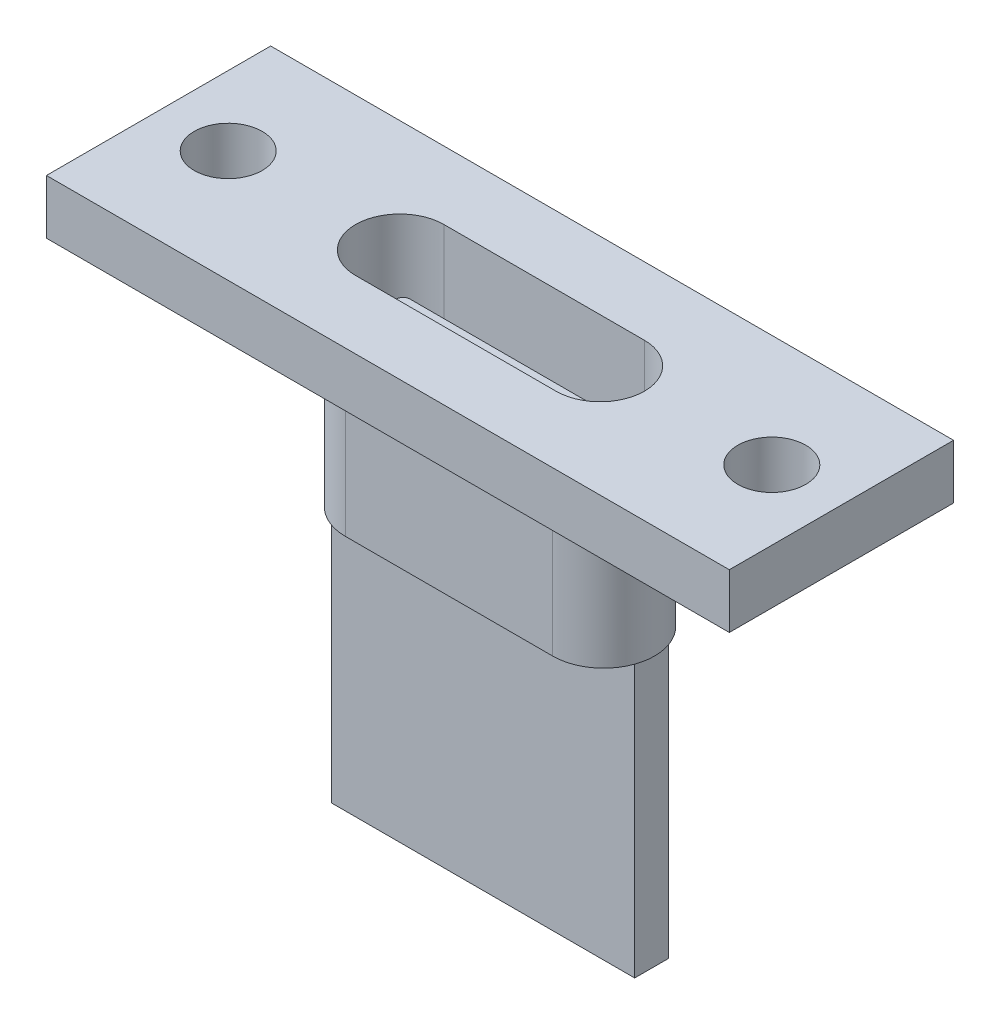
ISO-10303-21;
HEADER;
FILE_DESCRIPTION(('STEP AP214'),'2;1');
FILE_NAME('part.step','',(''),(''),'','','');
FILE_SCHEMA(('AUTOMOTIVE_DESIGN { 1 0 10303 214 1 1 1 1 }'));
ENDSEC;
DATA;
#1=APPLICATION_CONTEXT('core data for automotive mechanical design processes');
#2=APPLICATION_PROTOCOL_DEFINITION('international standard','automotive_design',2000,#1);
#3=PRODUCT_CONTEXT('',#1,'mechanical');
#4=PRODUCT('Part','Part','',(#3));
#5=PRODUCT_RELATED_PRODUCT_CATEGORY('part','',(#4));
#6=PRODUCT_DEFINITION_FORMATION('','',#4);
#7=PRODUCT_DEFINITION_CONTEXT('part definition',#1,'design');
#8=PRODUCT_DEFINITION('design','',#6,#7);
#9=PRODUCT_DEFINITION_SHAPE('','',#8);
#10=(LENGTH_UNIT() NAMED_UNIT(*) SI_UNIT(.MILLI.,.METRE.));
#11=(NAMED_UNIT(*) PLANE_ANGLE_UNIT() SI_UNIT($,.RADIAN.));
#12=(NAMED_UNIT(*) SI_UNIT($,.STERADIAN.) SOLID_ANGLE_UNIT());
#13=UNCERTAINTY_MEASURE_WITH_UNIT(LENGTH_MEASURE(1.E-05),#10,'distance_accuracy_value','');
#14=(GEOMETRIC_REPRESENTATION_CONTEXT(3) GLOBAL_UNCERTAINTY_ASSIGNED_CONTEXT((#13)) GLOBAL_UNIT_ASSIGNED_CONTEXT((#10,
#11,#12)) REPRESENTATION_CONTEXT('',''));
#15=CARTESIAN_POINT('',(0.,0.,0.));
#16=DIRECTION('',(0.,0.,1.));
#17=DIRECTION('',(1.,0.,0.));
#18=AXIS2_PLACEMENT_3D('',#15,#16,#17);
#19=CARTESIAN_POINT('',(-2.95,-3.4,0.));
#20=DIRECTION('',(0.,1.,0.));
#21=DIRECTION('',(0.,0.,1.));
#22=AXIS2_PLACEMENT_3D('',#19,#20,#21);
#23=PLANE('',#22);
#24=CARTESIAN_POINT('',(-2.95,-3.4,0.));
#25=DIRECTION('',(0.,1.,0.));
#26=DIRECTION('',(0.,0.,1.));
#27=AXIS2_PLACEMENT_3D('',#24,#25,#26);
#28=CIRCLE('',#27,1.3);
#29=CARTESIAN_POINT('',(-2.95,-3.4,-1.3));
#30=VERTEX_POINT('',#29);
#31=CARTESIAN_POINT('',(-2.95,-3.4,1.3));
#32=VERTEX_POINT('',#31);
#33=EDGE_CURVE('E244',#30,#32,#28,.T.);
#34=ORIENTED_EDGE('',*,*,#33,.T.);
#35=DIRECTION('',(1.,0.,0.));
#36=VECTOR('',#35,1.);
#37=CARTESIAN_POINT('',(-2.95,-3.4,1.3));
#38=LINE('',#37,#36);
#39=CARTESIAN_POINT('',(2.95,-3.4,1.3));
#40=VERTEX_POINT('',#39);
#41=EDGE_CURVE('E248',#32,#40,#38,.T.);
#42=ORIENTED_EDGE('',*,*,#41,.T.);
#43=CARTESIAN_POINT('',(2.95,-3.4,0.));
#44=DIRECTION('',(0.,1.,0.));
#45=DIRECTION('',(0.,0.,1.));
#46=AXIS2_PLACEMENT_3D('',#43,#44,#45);
#47=CIRCLE('',#46,1.3);
#48=CARTESIAN_POINT('',(2.95,-3.4,-1.3));
#49=VERTEX_POINT('',#48);
#50=EDGE_CURVE('E253',#40,#49,#47,.T.);
#51=ORIENTED_EDGE('',*,*,#50,.T.);
#52=DIRECTION('',(-1.,0.,0.));
#53=VECTOR('',#52,1.);
#54=CARTESIAN_POINT('',(-2.95,-3.4,-1.3));
#55=LINE('',#54,#53);
#56=EDGE_CURVE('E257',#49,#30,#55,.T.);
#57=ORIENTED_EDGE('',*,*,#56,.T.);
#58=EDGE_LOOP('',(#34,#42,#51,#57));
#59=FACE_BOUND('',#58,.T.);
#60=DIRECTION('',(-1.,0.,0.));
#61=VECTOR('',#60,1.);
#62=CARTESIAN_POINT('',(-3.05,-3.4,-0.4));
#63=LINE('',#62,#61);
#64=CARTESIAN_POINT('',(3.05,-3.4,-0.4));
#65=VERTEX_POINT('',#64);
#66=CARTESIAN_POINT('',(-3.05,-3.4,-0.4));
#67=VERTEX_POINT('',#66);
#68=EDGE_CURVE('E744',#65,#67,#63,.T.);
#69=ORIENTED_EDGE('',*,*,#68,.F.);
#70=CARTESIAN_POINT('',(3.05,-3.4,-0.2));
#71=DIRECTION('',(0.,1.,0.));
#72=DIRECTION('',(0.,0.,-1.));
#73=AXIS2_PLACEMENT_3D('',#70,#71,#72);
#74=CIRCLE('',#73,0.2);
#75=CARTESIAN_POINT('',(3.25,-3.4,-0.199999999999999));
#76=VERTEX_POINT('',#75);
#77=EDGE_CURVE('E232',#76,#65,#74,.T.);
#78=ORIENTED_EDGE('',*,*,#77,.F.);
#79=DIRECTION('',(0.,0.,-1.));
#80=VECTOR('',#79,1.);
#81=CARTESIAN_POINT('',(3.25,-3.4,0.199999999999999));
#82=LINE('',#81,#80);
#83=CARTESIAN_POINT('',(3.25,-3.4,0.199999999999999));
#84=VERTEX_POINT('',#83);
#85=EDGE_CURVE('E228',#84,#76,#82,.T.);
#86=ORIENTED_EDGE('',*,*,#85,.F.);
#87=CARTESIAN_POINT('',(3.05,-3.4,0.2));
#88=DIRECTION('',(0.,1.,0.));
#89=DIRECTION('',(0.,0.,1.));
#90=AXIS2_PLACEMENT_3D('',#87,#88,#89);
#91=CIRCLE('',#90,0.2);
#92=CARTESIAN_POINT('',(3.05,-3.4,0.4));
#93=VERTEX_POINT('',#92);
#94=EDGE_CURVE('E739',#93,#84,#91,.T.);
#95=ORIENTED_EDGE('',*,*,#94,.F.);
#96=DIRECTION('',(1.,0.,0.));
#97=VECTOR('',#96,1.);
#98=CARTESIAN_POINT('',(-3.05,-3.4,0.4));
#99=LINE('',#98,#97);
#100=CARTESIAN_POINT('',(-3.05,-3.4,0.4));
#101=VERTEX_POINT('',#100);
#102=EDGE_CURVE('E761',#101,#93,#99,.T.);
#103=ORIENTED_EDGE('',*,*,#102,.F.);
#104=CARTESIAN_POINT('',(-3.05,-3.4,0.2));
#105=DIRECTION('',(0.,1.,0.));
#106=DIRECTION('',(0.,0.,-1.));
#107=AXIS2_PLACEMENT_3D('',#104,#105,#106);
#108=CIRCLE('',#107,0.2);
#109=CARTESIAN_POINT('',(-3.25,-3.4,0.199999999999999));
#110=VERTEX_POINT('',#109);
#111=EDGE_CURVE('E758',#110,#101,#108,.T.);
#112=ORIENTED_EDGE('',*,*,#111,.F.);
#113=DIRECTION('',(0.,0.,1.));
#114=VECTOR('',#113,1.);
#115=CARTESIAN_POINT('',(-3.25,-3.4,0.199999999999999));
#116=LINE('',#115,#114);
#117=CARTESIAN_POINT('',(-3.25,-3.4,-0.199999999999998));
#118=VERTEX_POINT('',#117);
#119=EDGE_CURVE('E755',#118,#110,#116,.T.);
#120=ORIENTED_EDGE('',*,*,#119,.F.);
#121=CARTESIAN_POINT('',(-3.05,-3.4,-0.2));
#122=DIRECTION('',(0.,1.,0.));
#123=DIRECTION('',(0.,0.,-1.));
#124=AXIS2_PLACEMENT_3D('',#121,#122,#123);
#125=CIRCLE('',#124,0.2);
#126=EDGE_CURVE('E748',#67,#118,#125,.T.);
#127=ORIENTED_EDGE('',*,*,#126,.F.);
#128=EDGE_LOOP('',(#69,#78,#86,#95,#103,#112,#120,#127));
#129=FACE_BOUND('',#128,.T.);
#130=ADVANCED_FACE('F45',(#59,#129),#23,.T.);
#131=CARTESIAN_POINT('',(-3.05,-5.,0.));
#132=DIRECTION('',(0.,-1.,0.));
#133=DIRECTION('',(0.,0.,-1.));
#134=AXIS2_PLACEMENT_3D('',#131,#132,#133);
#135=PLANE('',#134);
#136=DIRECTION('',(0.,0.,1.));
#137=VECTOR('',#136,1.);
#138=CARTESIAN_POINT('',(4.4642135623731,-5.,-0.5));
#139=LINE('',#138,#137);
#140=CARTESIAN_POINT('',(4.4642135623731,-5.,-0.5));
#141=VERTEX_POINT('',#140);
#142=CARTESIAN_POINT('',(4.4642135623731,-5.,0.5));
#143=VERTEX_POINT('',#142);
#144=EDGE_CURVE('E275',#141,#143,#139,.T.);
#145=ORIENTED_EDGE('',*,*,#144,.F.);
#146=CARTESIAN_POINT('',(3.05,-5.,0.));
#147=DIRECTION('',(0.,-1.,0.));
#148=DIRECTION('',(0.,0.,-1.));
#149=AXIS2_PLACEMENT_3D('',#146,#147,#148);
#150=CIRCLE('',#149,1.5);
#151=EDGE_CURVE('E343',#141,#143,#150,.T.);
#152=ORIENTED_EDGE('',*,*,#151,.T.);
#153=EDGE_LOOP('',(#145,#152));
#154=FACE_BOUND('',#153,.T.);
#155=ADVANCED_FACE('F453',(#154),#135,.T.);
#156=DIRECTION('',(1.,0.,0.));
#157=VECTOR('',#156,1.);
#158=CARTESIAN_POINT('',(-4.4642135623731,-5.,-0.5));
#159=LINE('',#158,#157);
#160=CARTESIAN_POINT('',(-4.4642135623731,-5.,-0.499999999999998));
#161=VERTEX_POINT('',#160);
#162=EDGE_CURVE('E289',#161,#141,#159,.T.);
#163=ORIENTED_EDGE('',*,*,#162,.F.);
#164=CARTESIAN_POINT('',(-3.05,-5.,0.));
#165=DIRECTION('',(0.,-1.,0.));
#166=DIRECTION('',(0.,0.,-1.));
#167=AXIS2_PLACEMENT_3D('',#164,#165,#166);
#168=CIRCLE('',#167,1.5);
#169=CARTESIAN_POINT('',(-3.05,-5.,-1.5));
#170=VERTEX_POINT('',#169);
#171=EDGE_CURVE('E334',#161,#170,#168,.T.);
#172=ORIENTED_EDGE('',*,*,#171,.T.);
#173=DIRECTION('',(1.,0.,0.));
#174=VECTOR('',#173,1.);
#175=CARTESIAN_POINT('',(-3.05,-5.,-1.5));
#176=LINE('',#175,#174);
#177=CARTESIAN_POINT('',(3.05,-5.,-1.5));
#178=VERTEX_POINT('',#177);
#179=EDGE_CURVE('E332',#170,#178,#176,.T.);
#180=ORIENTED_EDGE('',*,*,#179,.T.);
#181=EDGE_CURVE('E338',#178,#141,#150,.T.);
#182=ORIENTED_EDGE('',*,*,#181,.T.);
#183=EDGE_LOOP('',(#163,#172,#180,#182));
#184=FACE_BOUND('',#183,.T.);
#185=ADVANCED_FACE('F461',(#184),#135,.T.);
#186=DIRECTION('',(0.,0.,-1.));
#187=VECTOR('',#186,1.);
#188=CARTESIAN_POINT('',(-4.4642135623731,-5.,-0.5));
#189=LINE('',#188,#187);
#190=CARTESIAN_POINT('',(-4.4642135623731,-5.,0.5));
#191=VERTEX_POINT('',#190);
#192=EDGE_CURVE('E306',#191,#161,#189,.T.);
#193=ORIENTED_EDGE('',*,*,#192,.F.);
#194=EDGE_CURVE('E333',#191,#161,#168,.T.);
#195=ORIENTED_EDGE('',*,*,#194,.T.);
#196=EDGE_LOOP('',(#193,#195));
#197=FACE_BOUND('',#196,.T.);
#198=ADVANCED_FACE('F506',(#197),#135,.T.);
#199=CARTESIAN_POINT('',(0.,0.,0.));
#200=DIRECTION('',(0.,-1.,0.));
#201=DIRECTION('',(0.,0.,-1.));
#202=AXIS2_PLACEMENT_3D('',#199,#200,#201);
#203=PLANE('',#202);
#204=CARTESIAN_POINT('',(8.,0.,0.));
#205=DIRECTION('',(0.,-1.,0.));
#206=DIRECTION('',(0.,0.,-1.));
#207=AXIS2_PLACEMENT_3D('',#204,#205,#206);
#208=CIRCLE('',#207,1.);
#209=CARTESIAN_POINT('',(8.,0.,-1.));
#210=VERTEX_POINT('',#209);
#211=EDGE_CURVE('E379',#210,#210,#208,.F.);
#212=ORIENTED_EDGE('',*,*,#211,.T.);
#213=EDGE_LOOP('',(#212));
#214=FACE_BOUND('',#213,.T.);
#215=CARTESIAN_POINT('',(-8.,0.,0.));
#216=DIRECTION('',(0.,-1.,0.));
#217=DIRECTION('',(0.,0.,-1.));
#218=AXIS2_PLACEMENT_3D('',#215,#216,#217);
#219=CIRCLE('',#218,1.);
#220=CARTESIAN_POINT('',(-8.,0.,-0.999999999999998));
#221=VERTEX_POINT('',#220);
#222=EDGE_CURVE('E383',#221,#221,#219,.F.);
#223=ORIENTED_EDGE('',*,*,#222,.T.);
#224=EDGE_LOOP('',(#223));
#225=FACE_BOUND('',#224,.T.);
#226=DIRECTION('',(0.,0.,-1.));
#227=VECTOR('',#226,1.);
#228=CARTESIAN_POINT('',(10.05,0.,3.3));
#229=LINE('',#228,#227);
#230=CARTESIAN_POINT('',(10.05,0.,3.3));
#231=VERTEX_POINT('',#230);
#232=CARTESIAN_POINT('',(10.05,0.,-3.3));
#233=VERTEX_POINT('',#232);
#234=EDGE_CURVE('E378',#231,#233,#229,.T.);
#235=ORIENTED_EDGE('',*,*,#234,.F.);
#236=DIRECTION('',(1.,0.,0.));
#237=VECTOR('',#236,1.);
#238=CARTESIAN_POINT('',(-10.05,0.,3.3));
#239=LINE('',#238,#237);
#240=CARTESIAN_POINT('',(-10.05,0.,3.3));
#241=VERTEX_POINT('',#240);
#242=EDGE_CURVE('E395',#241,#231,#239,.T.);
#243=ORIENTED_EDGE('',*,*,#242,.F.);
#244=DIRECTION('',(0.,0.,1.));
#245=VECTOR('',#244,1.);
#246=CARTESIAN_POINT('',(-10.05,0.,3.3));
#247=LINE('',#246,#245);
#248=CARTESIAN_POINT('',(-10.05,0.,-3.3));
#249=VERTEX_POINT('',#248);
#250=EDGE_CURVE('E411',#249,#241,#247,.T.);
#251=ORIENTED_EDGE('',*,*,#250,.F.);
#252=DIRECTION('',(-1.,0.,0.));
#253=VECTOR('',#252,1.);
#254=CARTESIAN_POINT('',(-10.05,0.,-3.3));
#255=LINE('',#254,#253);
#256=EDGE_CURVE('E408',#233,#249,#255,.T.);
#257=ORIENTED_EDGE('',*,*,#256,.F.);
#258=EDGE_LOOP('',(#235,#243,#251,#257));
#259=FACE_BOUND('',#258,.T.);
#260=DIRECTION('',(1.,0.,0.));
#261=VECTOR('',#260,1.);
#262=CARTESIAN_POINT('',(-3.05,0.,-1.5));
#263=LINE('',#262,#261);
#264=CARTESIAN_POINT('',(-3.05,0.,-1.5));
#265=VERTEX_POINT('',#264);
#266=CARTESIAN_POINT('',(3.05,0.,-1.5));
#267=VERTEX_POINT('',#266);
#268=EDGE_CURVE('E350',#265,#267,#263,.T.);
#269=ORIENTED_EDGE('',*,*,#268,.F.);
#270=CARTESIAN_POINT('',(-3.05,0.,0.));
#271=DIRECTION('',(0.,-1.,0.));
#272=DIRECTION('',(0.,0.,-1.));
#273=AXIS2_PLACEMENT_3D('',#270,#271,#272);
#274=CIRCLE('',#273,1.5);
#275=CARTESIAN_POINT('',(-3.05,0.,1.5));
#276=VERTEX_POINT('',#275);
#277=EDGE_CURVE('E328',#276,#265,#274,.T.);
#278=ORIENTED_EDGE('',*,*,#277,.F.);
#279=DIRECTION('',(-1.,0.,0.));
#280=VECTOR('',#279,1.);
#281=CARTESIAN_POINT('',(-3.05,0.,1.5));
#282=LINE('',#281,#280);
#283=CARTESIAN_POINT('',(3.05,0.,1.5));
#284=VERTEX_POINT('',#283);
#285=EDGE_CURVE('E357',#284,#276,#282,.T.);
#286=ORIENTED_EDGE('',*,*,#285,.F.);
#287=CARTESIAN_POINT('',(3.05,0.,0.));
#288=DIRECTION('',(0.,-1.,0.));
#289=DIRECTION('',(0.,0.,-1.));
#290=AXIS2_PLACEMENT_3D('',#287,#288,#289);
#291=CIRCLE('',#290,1.5);
#292=EDGE_CURVE('E353',#267,#284,#291,.T.);
#293=ORIENTED_EDGE('',*,*,#292,.F.);
#294=EDGE_LOOP('',(#269,#278,#286,#293));
#295=FACE_BOUND('',#294,.T.);
#296=ADVANCED_FACE('F434',(#214,#225,#259,#295),#203,.T.);
#297=CARTESIAN_POINT('',(10.05,1.6,3.3));
#298=DIRECTION('',(-1.,0.,0.));
#299=DIRECTION('',(0.,0.,1.));
#300=AXIS2_PLACEMENT_3D('',#297,#298,#299);
#301=PLANE('',#300);
#302=ORIENTED_EDGE('',*,*,#234,.T.);
#303=DIRECTION('',(0.,-1.,0.));
#304=VECTOR('',#303,1.);
#305=CARTESIAN_POINT('',(10.05,1.6,-3.3));
#306=LINE('',#305,#304);
#307=CARTESIAN_POINT('',(10.05,1.6,-3.3));
#308=VERTEX_POINT('',#307);
#309=EDGE_CURVE('E11',#308,#233,#306,.T.);
#310=ORIENTED_EDGE('',*,*,#309,.F.);
#311=DIRECTION('',(0.,0.,-1.));
#312=VECTOR('',#311,1.);
#313=CARTESIAN_POINT('',(10.05,1.6,3.3));
#314=LINE('',#313,#312);
#315=CARTESIAN_POINT('',(10.05,1.6,3.3));
#316=VERTEX_POINT('',#315);
#317=EDGE_CURVE('E390',#316,#308,#314,.T.);
#318=ORIENTED_EDGE('',*,*,#317,.F.);
#319=DIRECTION('',(0.,-1.,0.));
#320=VECTOR('',#319,1.);
#321=CARTESIAN_POINT('',(10.05,1.6,3.3));
#322=LINE('',#321,#320);
#323=EDGE_CURVE('E404',#316,#231,#322,.T.);
#324=ORIENTED_EDGE('',*,*,#323,.T.);
#325=EDGE_LOOP('',(#302,#310,#318,#324));
#326=FACE_BOUND('',#325,.T.);
#327=ADVANCED_FACE('F47',(#326),#301,.F.);
#328=CARTESIAN_POINT('',(-10.05,1.6,-3.3));
#329=DIRECTION('',(0.,0.,1.));
#330=DIRECTION('',(1.,0.,0.));
#331=AXIS2_PLACEMENT_3D('',#328,#329,#330);
#332=PLANE('',#331);
#333=ORIENTED_EDGE('',*,*,#256,.T.);
#334=DIRECTION('',(0.,-1.,0.));
#335=VECTOR('',#334,1.);
#336=CARTESIAN_POINT('',(-10.05,1.6,-3.3));
#337=LINE('',#336,#335);
#338=CARTESIAN_POINT('',(-10.05,1.6,-3.3));
#339=VERTEX_POINT('',#338);
#340=EDGE_CURVE('E54',#339,#249,#337,.T.);
#341=ORIENTED_EDGE('',*,*,#340,.F.);
#342=DIRECTION('',(-1.,0.,0.));
#343=VECTOR('',#342,1.);
#344=CARTESIAN_POINT('',(-10.05,1.6,-3.3));
#345=LINE('',#344,#343);
#346=EDGE_CURVE('E394',#308,#339,#345,.T.);
#347=ORIENTED_EDGE('',*,*,#346,.F.);
#348=ORIENTED_EDGE('',*,*,#309,.T.);
#349=EDGE_LOOP('',(#333,#341,#347,#348));
#350=FACE_BOUND('',#349,.T.);
#351=ADVANCED_FACE('F445',(#350),#332,.F.);
#352=CARTESIAN_POINT('',(-10.05,1.6,3.3));
#353=DIRECTION('',(1.,0.,0.));
#354=DIRECTION('',(0.,0.,-1.));
#355=AXIS2_PLACEMENT_3D('',#352,#353,#354);
#356=PLANE('',#355);
#357=ORIENTED_EDGE('',*,*,#250,.T.);
#358=DIRECTION('',(0.,-1.,0.));
#359=VECTOR('',#358,1.);
#360=CARTESIAN_POINT('',(-10.05,1.6,3.3));
#361=LINE('',#360,#359);
#362=CARTESIAN_POINT('',(-10.05,1.6,3.3));
#363=VERTEX_POINT('',#362);
#364=EDGE_CURVE('E419',#363,#241,#361,.T.);
#365=ORIENTED_EDGE('',*,*,#364,.F.);
#366=DIRECTION('',(0.,0.,1.));
#367=VECTOR('',#366,1.);
#368=CARTESIAN_POINT('',(-10.05,1.6,3.3));
#369=LINE('',#368,#367);
#370=EDGE_CURVE('E398',#339,#363,#369,.T.);
#371=ORIENTED_EDGE('',*,*,#370,.F.);
#372=ORIENTED_EDGE('',*,*,#340,.T.);
#373=EDGE_LOOP('',(#357,#365,#371,#372));
#374=FACE_BOUND('',#373,.T.);
#375=ADVANCED_FACE('F428',(#374),#356,.F.);
#376=CARTESIAN_POINT('',(-10.05,1.6,3.3));
#377=DIRECTION('',(0.,0.,-1.));
#378=DIRECTION('',(-1.,0.,0.));
#379=AXIS2_PLACEMENT_3D('',#376,#377,#378);
#380=PLANE('',#379);
#381=ORIENTED_EDGE('',*,*,#242,.T.);
#382=ORIENTED_EDGE('',*,*,#323,.F.);
#383=DIRECTION('',(1.,0.,0.));
#384=VECTOR('',#383,1.);
#385=CARTESIAN_POINT('',(-10.05,1.6,3.3));
#386=LINE('',#385,#384);
#387=EDGE_CURVE('E401',#363,#316,#386,.T.);
#388=ORIENTED_EDGE('',*,*,#387,.F.);
#389=ORIENTED_EDGE('',*,*,#364,.T.);
#390=EDGE_LOOP('',(#381,#382,#388,#389));
#391=FACE_BOUND('',#390,.T.);
#392=ADVANCED_FACE('F438',(#391),#380,.F.);
#393=CARTESIAN_POINT('',(0.,1.6,0.));
#394=DIRECTION('',(0.,-1.,0.));
#395=DIRECTION('',(0.,0.,-1.));
#396=AXIS2_PLACEMENT_3D('',#393,#394,#395);
#397=PLANE('',#396);
#398=DIRECTION('',(1.,0.,0.));
#399=VECTOR('',#398,1.);
#400=CARTESIAN_POINT('',(-2.95,1.6,1.3));
#401=LINE('',#400,#399);
#402=CARTESIAN_POINT('',(-2.95,1.6,1.3));
#403=VERTEX_POINT('',#402);
#404=CARTESIAN_POINT('',(2.95,1.6,1.3));
#405=VERTEX_POINT('',#404);
#406=EDGE_CURVE('E238',#403,#405,#401,.T.);
#407=ORIENTED_EDGE('',*,*,#406,.F.);
#408=CARTESIAN_POINT('',(-2.95,1.6,0.));
#409=DIRECTION('',(0.,1.,0.));
#410=DIRECTION('',(0.,0.,1.));
#411=AXIS2_PLACEMENT_3D('',#408,#409,#410);
#412=CIRCLE('',#411,1.3);
#413=CARTESIAN_POINT('',(-2.95,1.6,-1.3));
#414=VERTEX_POINT('',#413);
#415=EDGE_CURVE('E69',#414,#403,#412,.T.);
#416=ORIENTED_EDGE('',*,*,#415,.F.);
#417=DIRECTION('',(-1.,0.,0.));
#418=VECTOR('',#417,1.);
#419=CARTESIAN_POINT('',(-2.95,1.6,-1.3));
#420=LINE('',#419,#418);
#421=CARTESIAN_POINT('',(2.95,1.6,-1.3));
#422=VERTEX_POINT('',#421);
#423=EDGE_CURVE('E249',#422,#414,#420,.T.);
#424=ORIENTED_EDGE('',*,*,#423,.F.);
#425=CARTESIAN_POINT('',(2.95,1.6,0.));
#426=DIRECTION('',(0.,1.,0.));
#427=DIRECTION('',(0.,0.,1.));
#428=AXIS2_PLACEMENT_3D('',#425,#426,#427);
#429=CIRCLE('',#428,1.3);
#430=EDGE_CURVE('E265',#405,#422,#429,.T.);
#431=ORIENTED_EDGE('',*,*,#430,.F.);
#432=EDGE_LOOP('',(#407,#416,#424,#431));
#433=FACE_BOUND('',#432,.T.);
#434=CARTESIAN_POINT('',(8.,1.6,0.));
#435=DIRECTION('',(0.,1.,0.));
#436=DIRECTION('',(0.,0.,1.));
#437=AXIS2_PLACEMENT_3D('',#434,#435,#436);
#438=CIRCLE('',#437,1.);
#439=CARTESIAN_POINT('',(8.,1.6,1.));
#440=VERTEX_POINT('',#439);
#441=EDGE_CURVE('E374',#440,#440,#438,.T.);
#442=ORIENTED_EDGE('',*,*,#441,.F.);
#443=EDGE_LOOP('',(#442));
#444=FACE_BOUND('',#443,.T.);
#445=CARTESIAN_POINT('',(-8.,1.6,0.));
#446=DIRECTION('',(0.,1.,0.));
#447=DIRECTION('',(0.,0.,-1.));
#448=AXIS2_PLACEMENT_3D('',#445,#446,#447);
#449=CIRCLE('',#448,1.);
#450=CARTESIAN_POINT('',(-8.,1.6,-0.999999999999998));
#451=VERTEX_POINT('',#450);
#452=EDGE_CURVE('E373',#451,#451,#449,.T.);
#453=ORIENTED_EDGE('',*,*,#452,.F.);
#454=EDGE_LOOP('',(#453));
#455=FACE_BOUND('',#454,.T.);
#456=ORIENTED_EDGE('',*,*,#317,.T.);
#457=ORIENTED_EDGE('',*,*,#346,.T.);
#458=ORIENTED_EDGE('',*,*,#370,.T.);
#459=ORIENTED_EDGE('',*,*,#387,.T.);
#460=EDGE_LOOP('',(#456,#457,#458,#459));
#461=FACE_BOUND('',#460,.T.);
#462=ADVANCED_FACE('F444',(#433,#444,#455,#461),#397,.F.);
#463=CARTESIAN_POINT('',(-8.,-0.000999999999999916,0.));
#464=DIRECTION('',(0.,1.,0.));
#465=DIRECTION('',(0.,0.,1.));
#466=AXIS2_PLACEMENT_3D('',#463,#464,#465);
#467=CYLINDRICAL_SURFACE('',#466,1.);
#468=ORIENTED_EDGE('',*,*,#222,.F.);
#469=EDGE_LOOP('',(#468));
#470=FACE_BOUND('',#469,.T.);
#471=ORIENTED_EDGE('',*,*,#452,.T.);
#472=EDGE_LOOP('',(#471));
#473=FACE_BOUND('',#472,.T.);
#474=ADVANCED_FACE('F525',(#470,#473),#467,.F.);
#475=CARTESIAN_POINT('',(8.,-0.000999999999999916,0.));
#476=DIRECTION('',(0.,1.,0.));
#477=DIRECTION('',(0.,0.,1.));
#478=AXIS2_PLACEMENT_3D('',#475,#476,#477);
#479=CYLINDRICAL_SURFACE('',#478,1.);
#480=ORIENTED_EDGE('',*,*,#211,.F.);
#481=EDGE_LOOP('',(#480));
#482=FACE_BOUND('',#481,.T.);
#483=ORIENTED_EDGE('',*,*,#441,.T.);
#484=EDGE_LOOP('',(#483));
#485=FACE_BOUND('',#484,.T.);
#486=ADVANCED_FACE('F521',(#482,#485),#479,.F.);
#487=CARTESIAN_POINT('',(-3.05,-5.,0.));
#488=DIRECTION('',(0.,1.,0.));
#489=DIRECTION('',(0.,0.,1.));
#490=AXIS2_PLACEMENT_3D('',#487,#488,#489);
#491=CYLINDRICAL_SURFACE('',#490,1.5);
#492=ORIENTED_EDGE('',*,*,#277,.T.);
#493=DIRECTION('',(0.,1.,0.));
#494=VECTOR('',#493,1.);
#495=CARTESIAN_POINT('',(-3.05,-5.,-1.5));
#496=LINE('',#495,#494);
#497=EDGE_CURVE('E370',#170,#265,#496,.T.);
#498=ORIENTED_EDGE('',*,*,#497,.F.);
#499=ORIENTED_EDGE('',*,*,#171,.F.);
#500=ORIENTED_EDGE('',*,*,#194,.F.);
#501=CARTESIAN_POINT('',(-3.05,-5.,1.5));
#502=VERTEX_POINT('',#501);
#503=EDGE_CURVE('E329',#502,#191,#168,.T.);
#504=ORIENTED_EDGE('',*,*,#503,.F.);
#505=DIRECTION('',(0.,1.,0.));
#506=VECTOR('',#505,1.);
#507=CARTESIAN_POINT('',(-3.05,-5.,1.5));
#508=LINE('',#507,#506);
#509=EDGE_CURVE('E346',#502,#276,#508,.T.);
#510=ORIENTED_EDGE('',*,*,#509,.T.);
#511=EDGE_LOOP('',(#492,#498,#499,#500,#504,#510));
#512=FACE_BOUND('',#511,.T.);
#513=ADVANCED_FACE('F517',(#512),#491,.T.);
#514=CARTESIAN_POINT('',(-3.05,-5.,-1.5));
#515=DIRECTION('',(0.,0.,1.));
#516=DIRECTION('',(1.,0.,0.));
#517=AXIS2_PLACEMENT_3D('',#514,#515,#516);
#518=PLANE('',#517);
#519=ORIENTED_EDGE('',*,*,#268,.T.);
#520=DIRECTION('',(0.,1.,0.));
#521=VECTOR('',#520,1.);
#522=CARTESIAN_POINT('',(3.05,-5.,-1.5));
#523=LINE('',#522,#521);
#524=EDGE_CURVE('E366',#178,#267,#523,.T.);
#525=ORIENTED_EDGE('',*,*,#524,.F.);
#526=ORIENTED_EDGE('',*,*,#179,.F.);
#527=ORIENTED_EDGE('',*,*,#497,.T.);
#528=EDGE_LOOP('',(#519,#525,#526,#527));
#529=FACE_BOUND('',#528,.T.);
#530=ADVANCED_FACE('F513',(#529),#518,.F.);
#531=CARTESIAN_POINT('',(3.05,-5.,0.));
#532=DIRECTION('',(0.,1.,0.));
#533=DIRECTION('',(0.,0.,1.));
#534=AXIS2_PLACEMENT_3D('',#531,#532,#533);
#535=CYLINDRICAL_SURFACE('',#534,1.5);
#536=ORIENTED_EDGE('',*,*,#292,.T.);
#537=DIRECTION('',(0.,1.,0.));
#538=VECTOR('',#537,1.);
#539=CARTESIAN_POINT('',(3.05,-5.,1.5));
#540=LINE('',#539,#538);
#541=CARTESIAN_POINT('',(3.05,-5.,1.5));
#542=VERTEX_POINT('',#541);
#543=EDGE_CURVE('E363',#542,#284,#540,.T.);
#544=ORIENTED_EDGE('',*,*,#543,.F.);
#545=EDGE_CURVE('E337',#143,#542,#150,.T.);
#546=ORIENTED_EDGE('',*,*,#545,.F.);
#547=ORIENTED_EDGE('',*,*,#151,.F.);
#548=ORIENTED_EDGE('',*,*,#181,.F.);
#549=ORIENTED_EDGE('',*,*,#524,.T.);
#550=EDGE_LOOP('',(#536,#544,#546,#547,#548,#549));
#551=FACE_BOUND('',#550,.T.);
#552=ADVANCED_FACE('F509',(#551),#535,.T.);
#553=CARTESIAN_POINT('',(-3.05,-5.,1.5));
#554=DIRECTION('',(0.,0.,-1.));
#555=DIRECTION('',(-1.,0.,0.));
#556=AXIS2_PLACEMENT_3D('',#553,#554,#555);
#557=PLANE('',#556);
#558=ORIENTED_EDGE('',*,*,#285,.T.);
#559=ORIENTED_EDGE('',*,*,#509,.F.);
#560=DIRECTION('',(-1.,0.,0.));
#561=VECTOR('',#560,1.);
#562=CARTESIAN_POINT('',(-3.05,-5.,1.5));
#563=LINE('',#562,#561);
#564=EDGE_CURVE('E342',#542,#502,#563,.T.);
#565=ORIENTED_EDGE('',*,*,#564,.F.);
#566=ORIENTED_EDGE('',*,*,#543,.T.);
#567=EDGE_LOOP('',(#558,#559,#565,#566));
#568=FACE_BOUND('',#567,.T.);
#569=ADVANCED_FACE('F504',(#568),#557,.F.);
#570=DIRECTION('',(-1.,0.,0.));
#571=VECTOR('',#570,1.);
#572=CARTESIAN_POINT('',(-4.4642135623731,-5.,0.5));
#573=LINE('',#572,#571);
#574=EDGE_CURVE('E302',#143,#191,#573,.T.);
#575=ORIENTED_EDGE('',*,*,#574,.F.);
#576=ORIENTED_EDGE('',*,*,#545,.T.);
#577=ORIENTED_EDGE('',*,*,#564,.T.);
#578=ORIENTED_EDGE('',*,*,#503,.T.);
#579=EDGE_LOOP('',(#575,#576,#577,#578));
#580=FACE_BOUND('',#579,.T.);
#581=ADVANCED_FACE('F464',(#580),#135,.T.);
#582=CARTESIAN_POINT('',(4.4642135623731,-13.,-0.5));
#583=DIRECTION('',(-1.,0.,0.));
#584=DIRECTION('',(0.,0.,1.));
#585=AXIS2_PLACEMENT_3D('',#582,#583,#584);
#586=PLANE('',#585);
#587=ORIENTED_EDGE('',*,*,#144,.T.);
#588=DIRECTION('',(0.,1.,0.));
#589=VECTOR('',#588,1.);
#590=CARTESIAN_POINT('',(4.4642135623731,-13.,0.5));
#591=LINE('',#590,#589);
#592=CARTESIAN_POINT('',(4.4642135623731,-13.,0.5));
#593=VERTEX_POINT('',#592);
#594=EDGE_CURVE('E324',#593,#143,#591,.T.);
#595=ORIENTED_EDGE('',*,*,#594,.F.);
#596=DIRECTION('',(0.,0.,1.));
#597=VECTOR('',#596,1.);
#598=CARTESIAN_POINT('',(4.4642135623731,-13.,-0.5));
#599=LINE('',#598,#597);
#600=CARTESIAN_POINT('',(4.4642135623731,-13.,-0.5));
#601=VERTEX_POINT('',#600);
#602=EDGE_CURVE('E284',#601,#593,#599,.T.);
#603=ORIENTED_EDGE('',*,*,#602,.F.);
#604=DIRECTION('',(0.,1.,0.));
#605=VECTOR('',#604,1.);
#606=CARTESIAN_POINT('',(4.4642135623731,-13.,-0.5));
#607=LINE('',#606,#605);
#608=EDGE_CURVE('E298',#601,#141,#607,.T.);
#609=ORIENTED_EDGE('',*,*,#608,.T.);
#610=EDGE_LOOP('',(#587,#595,#603,#609));
#611=FACE_BOUND('',#610,.T.);
#612=ADVANCED_FACE('F498',(#611),#586,.F.);
#613=CARTESIAN_POINT('',(-4.4642135623731,-13.,0.5));
#614=DIRECTION('',(0.,0.,-1.));
#615=DIRECTION('',(-1.,0.,0.));
#616=AXIS2_PLACEMENT_3D('',#613,#614,#615);
#617=PLANE('',#616);
#618=ORIENTED_EDGE('',*,*,#574,.T.);
#619=DIRECTION('',(0.,1.,0.));
#620=VECTOR('',#619,1.);
#621=CARTESIAN_POINT('',(-4.4642135623731,-13.,0.5));
#622=LINE('',#621,#620);
#623=CARTESIAN_POINT('',(-4.4642135623731,-13.,0.5));
#624=VERTEX_POINT('',#623);
#625=EDGE_CURVE('E320',#624,#191,#622,.T.);
#626=ORIENTED_EDGE('',*,*,#625,.F.);
#627=DIRECTION('',(-1.,0.,0.));
#628=VECTOR('',#627,1.);
#629=CARTESIAN_POINT('',(-4.4642135623731,-13.,0.5));
#630=LINE('',#629,#628);
#631=EDGE_CURVE('E288',#593,#624,#630,.T.);
#632=ORIENTED_EDGE('',*,*,#631,.F.);
#633=ORIENTED_EDGE('',*,*,#594,.T.);
#634=EDGE_LOOP('',(#618,#626,#632,#633));
#635=FACE_BOUND('',#634,.T.);
#636=ADVANCED_FACE('F494',(#635),#617,.F.);
#637=CARTESIAN_POINT('',(-4.4642135623731,-13.,-0.5));
#638=DIRECTION('',(1.,0.,0.));
#639=DIRECTION('',(0.,0.,-1.));
#640=AXIS2_PLACEMENT_3D('',#637,#638,#639);
#641=PLANE('',#640);
#642=ORIENTED_EDGE('',*,*,#192,.T.);
#643=DIRECTION('',(0.,1.,0.));
#644=VECTOR('',#643,1.);
#645=CARTESIAN_POINT('',(-4.4642135623731,-13.,-0.5));
#646=LINE('',#645,#644);
#647=CARTESIAN_POINT('',(-4.4642135623731,-13.,-0.5));
#648=VERTEX_POINT('',#647);
#649=EDGE_CURVE('E316',#648,#161,#646,.T.);
#650=ORIENTED_EDGE('',*,*,#649,.F.);
#651=DIRECTION('',(0.,0.,-1.));
#652=VECTOR('',#651,1.);
#653=CARTESIAN_POINT('',(-4.4642135623731,-13.,-0.5));
#654=LINE('',#653,#652);
#655=EDGE_CURVE('E292',#624,#648,#654,.T.);
#656=ORIENTED_EDGE('',*,*,#655,.F.);
#657=ORIENTED_EDGE('',*,*,#625,.T.);
#658=EDGE_LOOP('',(#642,#650,#656,#657));
#659=FACE_BOUND('',#658,.T.);
#660=ADVANCED_FACE('F490',(#659),#641,.F.);
#661=CARTESIAN_POINT('',(-4.4642135623731,-13.,-0.5));
#662=DIRECTION('',(0.,0.,1.));
#663=DIRECTION('',(1.,0.,0.));
#664=AXIS2_PLACEMENT_3D('',#661,#662,#663);
#665=PLANE('',#664);
#666=ORIENTED_EDGE('',*,*,#162,.T.);
#667=ORIENTED_EDGE('',*,*,#608,.F.);
#668=DIRECTION('',(1.,0.,0.));
#669=VECTOR('',#668,1.);
#670=CARTESIAN_POINT('',(-4.4642135623731,-13.,-0.5));
#671=LINE('',#670,#669);
#672=EDGE_CURVE('E295',#648,#601,#671,.T.);
#673=ORIENTED_EDGE('',*,*,#672,.F.);
#674=ORIENTED_EDGE('',*,*,#649,.T.);
#675=EDGE_LOOP('',(#666,#667,#673,#674));
#676=FACE_BOUND('',#675,.T.);
#677=ADVANCED_FACE('F486',(#676),#665,.F.);
#678=CARTESIAN_POINT('',(0.,-13.,0.));
#679=DIRECTION('',(0.,1.,0.));
#680=DIRECTION('',(0.,0.,1.));
#681=AXIS2_PLACEMENT_3D('',#678,#679,#680);
#682=PLANE('',#681);
#683=ORIENTED_EDGE('',*,*,#602,.T.);
#684=ORIENTED_EDGE('',*,*,#631,.T.);
#685=ORIENTED_EDGE('',*,*,#655,.T.);
#686=ORIENTED_EDGE('',*,*,#672,.T.);
#687=EDGE_LOOP('',(#683,#684,#685,#686));
#688=FACE_BOUND('',#687,.T.);
#689=ADVANCED_FACE('F483',(#688),#682,.F.);
#690=CARTESIAN_POINT('',(-2.95,-3.4,0.));
#691=DIRECTION('',(0.,1.,0.));
#692=DIRECTION('',(0.,0.,1.));
#693=AXIS2_PLACEMENT_3D('',#690,#691,#692);
#694=CYLINDRICAL_SURFACE('',#693,1.3);
#695=ORIENTED_EDGE('',*,*,#415,.T.);
#696=DIRECTION('',(0.,1.,0.));
#697=VECTOR('',#696,1.);
#698=CARTESIAN_POINT('',(-2.95,-3.4,1.3));
#699=LINE('',#698,#697);
#700=EDGE_CURVE('E260',#32,#403,#699,.T.);
#701=ORIENTED_EDGE('',*,*,#700,.F.);
#702=ORIENTED_EDGE('',*,*,#33,.F.);
#703=DIRECTION('',(0.,1.,0.));
#704=VECTOR('',#703,1.);
#705=CARTESIAN_POINT('',(-2.95,-3.4,-1.3));
#706=LINE('',#705,#704);
#707=EDGE_CURVE('E272',#30,#414,#706,.T.);
#708=ORIENTED_EDGE('',*,*,#707,.T.);
#709=EDGE_LOOP('',(#695,#701,#702,#708));
#710=FACE_BOUND('',#709,.T.);
#711=ADVANCED_FACE('F473',(#710),#694,.F.);
#712=CARTESIAN_POINT('',(-2.95,-3.4,-1.3));
#713=DIRECTION('',(0.,0.,-1.));
#714=DIRECTION('',(-1.,0.,0.));
#715=AXIS2_PLACEMENT_3D('',#712,#713,#714);
#716=PLANE('',#715);
#717=ORIENTED_EDGE('',*,*,#423,.T.);
#718=ORIENTED_EDGE('',*,*,#707,.F.);
#719=ORIENTED_EDGE('',*,*,#56,.F.);
#720=DIRECTION('',(0.,1.,0.));
#721=VECTOR('',#720,1.);
#722=CARTESIAN_POINT('',(2.95,-3.4,-1.3));
#723=LINE('',#722,#721);
#724=EDGE_CURVE('E276',#49,#422,#723,.T.);
#725=ORIENTED_EDGE('',*,*,#724,.T.);
#726=EDGE_LOOP('',(#717,#718,#719,#725));
#727=FACE_BOUND('',#726,.T.);
#728=ADVANCED_FACE('F469',(#727),#716,.F.);
#729=CARTESIAN_POINT('',(2.95,-3.4,0.));
#730=DIRECTION('',(0.,1.,0.));
#731=DIRECTION('',(0.,0.,1.));
#732=AXIS2_PLACEMENT_3D('',#729,#730,#731);
#733=CYLINDRICAL_SURFACE('',#732,1.3);
#734=ORIENTED_EDGE('',*,*,#430,.T.);
#735=ORIENTED_EDGE('',*,*,#724,.F.);
#736=ORIENTED_EDGE('',*,*,#50,.F.);
#737=DIRECTION('',(0.,1.,0.));
#738=VECTOR('',#737,1.);
#739=CARTESIAN_POINT('',(2.95,-3.4,1.3));
#740=LINE('',#739,#738);
#741=EDGE_CURVE('E279',#40,#405,#740,.T.);
#742=ORIENTED_EDGE('',*,*,#741,.T.);
#743=EDGE_LOOP('',(#734,#735,#736,#742));
#744=FACE_BOUND('',#743,.T.);
#745=ADVANCED_FACE('F472',(#744),#733,.F.);
#746=CARTESIAN_POINT('',(-2.95,-3.4,1.3));
#747=DIRECTION('',(0.,0.,1.));
#748=DIRECTION('',(1.,0.,0.));
#749=AXIS2_PLACEMENT_3D('',#746,#747,#748);
#750=PLANE('',#749);
#751=ORIENTED_EDGE('',*,*,#406,.T.);
#752=ORIENTED_EDGE('',*,*,#741,.F.);
#753=ORIENTED_EDGE('',*,*,#41,.F.);
#754=ORIENTED_EDGE('',*,*,#700,.T.);
#755=EDGE_LOOP('',(#751,#752,#753,#754));
#756=FACE_BOUND('',#755,.T.);
#757=ADVANCED_FACE('F477',(#756),#750,.F.);
#758=CARTESIAN_POINT('',(3.05,0.0999999999999998,-0.2));
#759=DIRECTION('',(0.,-1.,0.));
#760=DIRECTION('',(0.,0.,-1.));
#761=AXIS2_PLACEMENT_3D('',#758,#759,#760);
#762=CYLINDRICAL_SURFACE('',#761,0.2);
#763=ORIENTED_EDGE('',*,*,#77,.T.);
#764=DIRECTION('',(0.,-1.,0.));
#765=VECTOR('',#764,1.);
#766=CARTESIAN_POINT('',(3.05,0.0999999999999998,-0.4));
#767=LINE('',#766,#765);
#768=CARTESIAN_POINT('',(3.05,0.0999999999999998,-0.4));
#769=VERTEX_POINT('',#768);
#770=EDGE_CURVE('E211',#769,#65,#767,.T.);
#771=ORIENTED_EDGE('',*,*,#770,.F.);
#772=CARTESIAN_POINT('',(3.05,0.0999999999999998,-0.2));
#773=DIRECTION('',(0.,1.,0.));
#774=DIRECTION('',(0.,0.,-1.));
#775=AXIS2_PLACEMENT_3D('',#772,#773,#774);
#776=CIRCLE('',#775,0.2);
#777=CARTESIAN_POINT('',(3.25,0.0999999999999998,-0.199999999999999));
#778=VERTEX_POINT('',#777);
#779=EDGE_CURVE('E219',#778,#769,#776,.T.);
#780=ORIENTED_EDGE('',*,*,#779,.F.);
#781=DIRECTION('',(0.,-1.,0.));
#782=VECTOR('',#781,1.);
#783=CARTESIAN_POINT('',(3.25,0.0999999999999998,-0.199999999999999));
#784=LINE('',#783,#782);
#785=EDGE_CURVE('E736',#778,#76,#784,.T.);
#786=ORIENTED_EDGE('',*,*,#785,.T.);
#787=EDGE_LOOP('',(#763,#771,#780,#786));
#788=FACE_BOUND('',#787,.T.);
#789=ADVANCED_FACE('F230',(#788),#762,.T.);
#790=CARTESIAN_POINT('',(-3.05,0.0999999999999998,-0.4));
#791=DIRECTION('',(0.,0.,1.));
#792=DIRECTION('',(1.,0.,0.));
#793=AXIS2_PLACEMENT_3D('',#790,#791,#792);
#794=PLANE('',#793);
#795=ORIENTED_EDGE('',*,*,#68,.T.);
#796=DIRECTION('',(0.,-1.,0.));
#797=VECTOR('',#796,1.);
#798=CARTESIAN_POINT('',(-3.05,0.0999999999999998,-0.4));
#799=LINE('',#798,#797);
#800=CARTESIAN_POINT('',(-3.05,0.0999999999999998,-0.4));
#801=VERTEX_POINT('',#800);
#802=EDGE_CURVE('E214',#801,#67,#799,.T.);
#803=ORIENTED_EDGE('',*,*,#802,.F.);
#804=DIRECTION('',(-1.,0.,0.));
#805=VECTOR('',#804,1.);
#806=CARTESIAN_POINT('',(-3.05,0.0999999999999998,-0.4));
#807=LINE('',#806,#805);
#808=EDGE_CURVE('E207',#769,#801,#807,.T.);
#809=ORIENTED_EDGE('',*,*,#808,.F.);
#810=ORIENTED_EDGE('',*,*,#770,.T.);
#811=EDGE_LOOP('',(#795,#803,#809,#810));
#812=FACE_BOUND('',#811,.T.);
#813=ADVANCED_FACE('F209',(#812),#794,.F.);
#814=CARTESIAN_POINT('',(-3.05,0.0999999999999998,-0.2));
#815=DIRECTION('',(0.,-1.,0.));
#816=DIRECTION('',(0.,0.,-1.));
#817=AXIS2_PLACEMENT_3D('',#814,#815,#816);
#818=CYLINDRICAL_SURFACE('',#817,0.2);
#819=ORIENTED_EDGE('',*,*,#126,.T.);
#820=DIRECTION('',(0.,-1.,0.));
#821=VECTOR('',#820,1.);
#822=CARTESIAN_POINT('',(-3.25,0.0999999999999998,-0.199999999999998));
#823=LINE('',#822,#821);
#824=CARTESIAN_POINT('',(-3.25,0.0999999999999998,-0.199999999999998));
#825=VERTEX_POINT('',#824);
#826=EDGE_CURVE('E240',#825,#118,#823,.T.);
#827=ORIENTED_EDGE('',*,*,#826,.F.);
#828=CARTESIAN_POINT('',(-3.05,0.0999999999999998,-0.2));
#829=DIRECTION('',(0.,1.,0.));
#830=DIRECTION('',(0.,0.,-1.));
#831=AXIS2_PLACEMENT_3D('',#828,#829,#830);
#832=CIRCLE('',#831,0.2);
#833=EDGE_CURVE('E218',#801,#825,#832,.T.);
#834=ORIENTED_EDGE('',*,*,#833,.F.);
#835=ORIENTED_EDGE('',*,*,#802,.T.);
#836=EDGE_LOOP('',(#819,#827,#834,#835));
#837=FACE_BOUND('',#836,.T.);
#838=ADVANCED_FACE('F667',(#837),#818,.T.);
#839=CARTESIAN_POINT('',(-3.25,0.0999999999999998,0.199999999999999));
#840=DIRECTION('',(1.,0.,0.));
#841=DIRECTION('',(0.,0.,-1.));
#842=AXIS2_PLACEMENT_3D('',#839,#840,#841);
#843=PLANE('',#842);
#844=ORIENTED_EDGE('',*,*,#119,.T.);
#845=DIRECTION('',(0.,-1.,0.));
#846=VECTOR('',#845,1.);
#847=CARTESIAN_POINT('',(-3.25,0.0999999999999998,0.199999999999999));
#848=LINE('',#847,#846);
#849=CARTESIAN_POINT('',(-3.25,0.0999999999999998,0.199999999999999));
#850=VERTEX_POINT('',#849);
#851=EDGE_CURVE('E776',#850,#110,#848,.T.);
#852=ORIENTED_EDGE('',*,*,#851,.F.);
#853=DIRECTION('',(0.,0.,1.));
#854=VECTOR('',#853,1.);
#855=CARTESIAN_POINT('',(-3.25,0.0999999999999998,0.199999999999999));
#856=LINE('',#855,#854);
#857=EDGE_CURVE('E785',#825,#850,#856,.T.);
#858=ORIENTED_EDGE('',*,*,#857,.F.);
#859=ORIENTED_EDGE('',*,*,#826,.T.);
#860=EDGE_LOOP('',(#844,#852,#858,#859));
#861=FACE_BOUND('',#860,.T.);
#862=ADVANCED_FACE('F675',(#861),#843,.F.);
#863=CARTESIAN_POINT('',(-3.05,0.0999999999999998,0.2));
#864=DIRECTION('',(0.,-1.,0.));
#865=DIRECTION('',(0.,0.,-1.));
#866=AXIS2_PLACEMENT_3D('',#863,#864,#865);
#867=CYLINDRICAL_SURFACE('',#866,0.2);
#868=ORIENTED_EDGE('',*,*,#111,.T.);
#869=DIRECTION('',(0.,-1.,0.));
#870=VECTOR('',#869,1.);
#871=CARTESIAN_POINT('',(-3.05,0.0999999999999998,0.4));
#872=LINE('',#871,#870);
#873=CARTESIAN_POINT('',(-3.05,0.0999999999999998,0.4));
#874=VERTEX_POINT('',#873);
#875=EDGE_CURVE('E772',#874,#101,#872,.T.);
#876=ORIENTED_EDGE('',*,*,#875,.F.);
#877=CARTESIAN_POINT('',(-3.05,0.0999999999999998,0.2));
#878=DIRECTION('',(0.,1.,0.));
#879=DIRECTION('',(0.,0.,-1.));
#880=AXIS2_PLACEMENT_3D('',#877,#878,#879);
#881=CIRCLE('',#880,0.2);
#882=EDGE_CURVE('E796',#850,#874,#881,.T.);
#883=ORIENTED_EDGE('',*,*,#882,.F.);
#884=ORIENTED_EDGE('',*,*,#851,.T.);
#885=EDGE_LOOP('',(#868,#876,#883,#884));
#886=FACE_BOUND('',#885,.T.);
#887=ADVANCED_FACE('F685',(#886),#867,.T.);
#888=CARTESIAN_POINT('',(-3.05,0.0999999999999998,0.4));
#889=DIRECTION('',(0.,0.,-1.));
#890=DIRECTION('',(-1.,0.,0.));
#891=AXIS2_PLACEMENT_3D('',#888,#889,#890);
#892=PLANE('',#891);
#893=ORIENTED_EDGE('',*,*,#102,.T.);
#894=DIRECTION('',(0.,-1.,0.));
#895=VECTOR('',#894,1.);
#896=CARTESIAN_POINT('',(3.05,0.0999999999999998,0.4));
#897=LINE('',#896,#895);
#898=CARTESIAN_POINT('',(3.05,0.0999999999999998,0.4));
#899=VERTEX_POINT('',#898);
#900=EDGE_CURVE('E768',#899,#93,#897,.T.);
#901=ORIENTED_EDGE('',*,*,#900,.F.);
#902=DIRECTION('',(1.,0.,0.));
#903=VECTOR('',#902,1.);
#904=CARTESIAN_POINT('',(-3.05,0.0999999999999998,0.4));
#905=LINE('',#904,#903);
#906=EDGE_CURVE('E792',#874,#899,#905,.T.);
#907=ORIENTED_EDGE('',*,*,#906,.F.);
#908=ORIENTED_EDGE('',*,*,#875,.T.);
#909=EDGE_LOOP('',(#893,#901,#907,#908));
#910=FACE_BOUND('',#909,.T.);
#911=ADVANCED_FACE('F695',(#910),#892,.F.);
#912=CARTESIAN_POINT('',(3.05,0.0999999999999998,0.2));
#913=DIRECTION('',(0.,-1.,0.));
#914=DIRECTION('',(0.,0.,-1.));
#915=AXIS2_PLACEMENT_3D('',#912,#913,#914);
#916=CYLINDRICAL_SURFACE('',#915,0.2);
#917=ORIENTED_EDGE('',*,*,#94,.T.);
#918=DIRECTION('',(0.,-1.,0.));
#919=VECTOR('',#918,1.);
#920=CARTESIAN_POINT('',(3.25,0.0999999999999998,0.199999999999999));
#921=LINE('',#920,#919);
#922=CARTESIAN_POINT('',(3.25,0.0999999999999998,0.199999999999999));
#923=VERTEX_POINT('',#922);
#924=EDGE_CURVE('E61',#923,#84,#921,.T.);
#925=ORIENTED_EDGE('',*,*,#924,.F.);
#926=CARTESIAN_POINT('',(3.05,0.0999999999999998,0.2));
#927=DIRECTION('',(0.,1.,0.));
#928=DIRECTION('',(0.,0.,1.));
#929=AXIS2_PLACEMENT_3D('',#926,#927,#928);
#930=CIRCLE('',#929,0.2);
#931=EDGE_CURVE('E795',#899,#923,#930,.T.);
#932=ORIENTED_EDGE('',*,*,#931,.F.);
#933=ORIENTED_EDGE('',*,*,#900,.T.);
#934=EDGE_LOOP('',(#917,#925,#932,#933));
#935=FACE_BOUND('',#934,.T.);
#936=ADVANCED_FACE('F705',(#935),#916,.T.);
#937=CARTESIAN_POINT('',(3.25,0.0999999999999998,0.199999999999999));
#938=DIRECTION('',(-1.,0.,0.));
#939=DIRECTION('',(0.,0.,1.));
#940=AXIS2_PLACEMENT_3D('',#937,#938,#939);
#941=PLANE('',#940);
#942=ORIENTED_EDGE('',*,*,#85,.T.);
#943=ORIENTED_EDGE('',*,*,#785,.F.);
#944=DIRECTION('',(0.,0.,-1.));
#945=VECTOR('',#944,1.);
#946=CARTESIAN_POINT('',(3.25,0.0999999999999998,0.199999999999999));
#947=LINE('',#946,#945);
#948=EDGE_CURVE('E223',#923,#778,#947,.T.);
#949=ORIENTED_EDGE('',*,*,#948,.F.);
#950=ORIENTED_EDGE('',*,*,#924,.T.);
#951=EDGE_LOOP('',(#942,#943,#949,#950));
#952=FACE_BOUND('',#951,.T.);
#953=ADVANCED_FACE('F715',(#952),#941,.F.);
#954=CARTESIAN_POINT('',(3.05,0.0999999999999998,-0.2));
#955=DIRECTION('',(0.,-1.,0.));
#956=DIRECTION('',(0.,0.,-1.));
#957=AXIS2_PLACEMENT_3D('',#954,#955,#956);
#958=PLANE('',#957);
#959=ORIENTED_EDGE('',*,*,#779,.T.);
#960=ORIENTED_EDGE('',*,*,#808,.T.);
#961=ORIENTED_EDGE('',*,*,#833,.T.);
#962=ORIENTED_EDGE('',*,*,#857,.T.);
#963=ORIENTED_EDGE('',*,*,#882,.T.);
#964=ORIENTED_EDGE('',*,*,#906,.T.);
#965=ORIENTED_EDGE('',*,*,#931,.T.);
#966=ORIENTED_EDGE('',*,*,#948,.T.);
#967=EDGE_LOOP('',(#959,#960,#961,#962,#963,#964,#965,#966));
#968=FACE_BOUND('',#967,.T.);
#969=ADVANCED_FACE('F222',(#968),#958,.F.);
#970=CLOSED_SHELL('',(#130,#155,#185,#198,#296,#327,#351,#375,#392,#462,#474,#486,#513,#530,
#552,#569,#581,#612,#636,#660,#677,#689,#711,#728,#745,#757,#789,#813,#838,#862,#887,#911,#936,
#953,#969));
#971=MANIFOLD_SOLID_BREP('B2',#970);
#972=ADVANCED_BREP_SHAPE_REPRESENTATION('',(#18,#971),#14);
#973=SHAPE_DEFINITION_REPRESENTATION(#9,#972);
ENDSEC;
END-ISO-10303-21;
